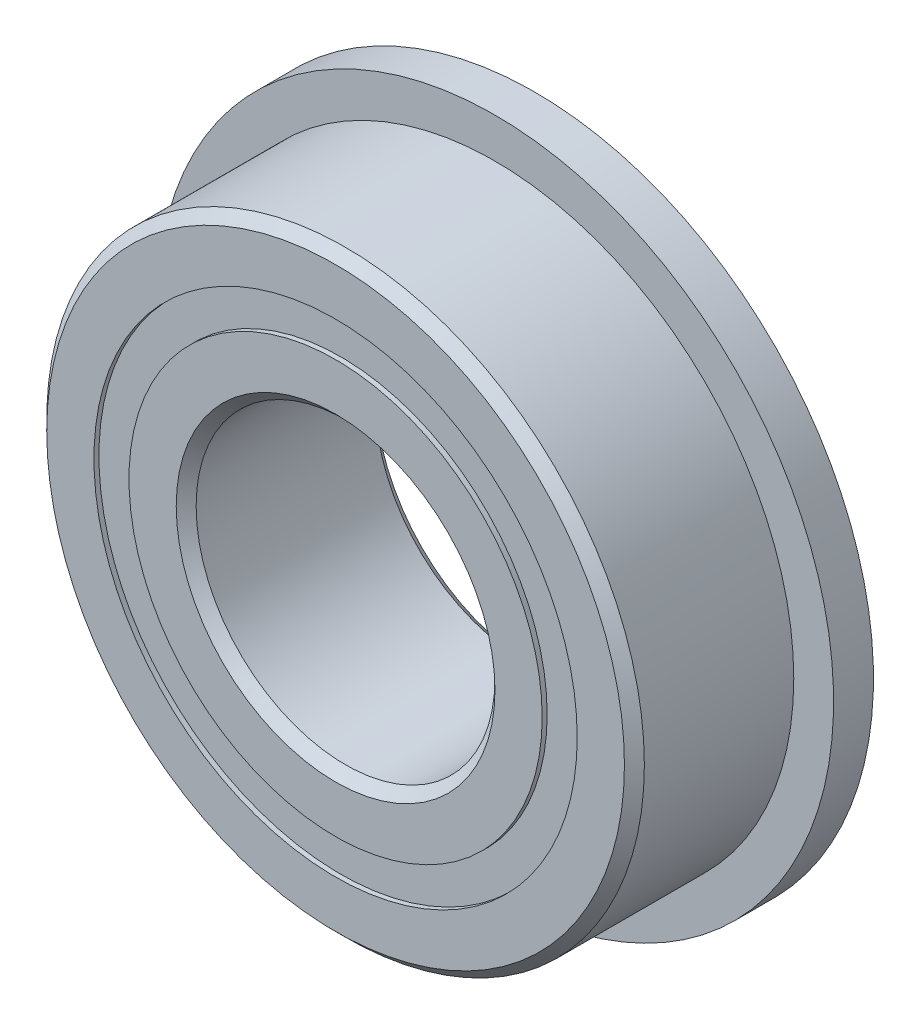
ISO-10303-21;
HEADER;
FILE_DESCRIPTION(('STEP AP214'),'2;1');
FILE_NAME('part.step','',(''),(''),'','','');
FILE_SCHEMA(('AUTOMOTIVE_DESIGN { 1 0 10303 214 1 1 1 1 }'));
ENDSEC;
DATA;
#1=APPLICATION_CONTEXT('core data for automotive mechanical design processes');
#2=APPLICATION_PROTOCOL_DEFINITION('international standard','automotive_design',2000,#1);
#3=PRODUCT_CONTEXT('',#1,'mechanical');
#4=PRODUCT('Part','Part','',(#3));
#5=PRODUCT_RELATED_PRODUCT_CATEGORY('part','',(#4));
#6=PRODUCT_DEFINITION_FORMATION('','',#4);
#7=PRODUCT_DEFINITION_CONTEXT('part definition',#1,'design');
#8=PRODUCT_DEFINITION('design','',#6,#7);
#9=PRODUCT_DEFINITION_SHAPE('','',#8);
#10=(LENGTH_UNIT() NAMED_UNIT(*) SI_UNIT(.MILLI.,.METRE.));
#11=(NAMED_UNIT(*) PLANE_ANGLE_UNIT() SI_UNIT($,.RADIAN.));
#12=(NAMED_UNIT(*) SI_UNIT($,.STERADIAN.) SOLID_ANGLE_UNIT());
#13=UNCERTAINTY_MEASURE_WITH_UNIT(LENGTH_MEASURE(1.E-05),#10,'distance_accuracy_value','');
#14=(GEOMETRIC_REPRESENTATION_CONTEXT(3) GLOBAL_UNCERTAINTY_ASSIGNED_CONTEXT((#13)) GLOBAL_UNIT_ASSIGNED_CONTEXT((#10,
#11,#12)) REPRESENTATION_CONTEXT('',''));
#15=CARTESIAN_POINT('',(0.,0.,0.));
#16=DIRECTION('',(0.,0.,1.));
#17=DIRECTION('',(1.,0.,0.));
#18=AXIS2_PLACEMENT_3D('',#15,#16,#17);
#19=CARTESIAN_POINT('',(0.,4.85164835164835,-1.9));
#20=DIRECTION('',(0.,0.,1.));
#21=DIRECTION('',(1.,0.,0.));
#22=AXIS2_PLACEMENT_3D('',#19,#20,#21);
#23=PLANE('',#22);
#24=CARTESIAN_POINT('',(0.,0.,-1.9));
#25=DIRECTION('',(0.,0.,1.));
#26=DIRECTION('',(1.,0.,0.));
#27=AXIS2_PLACEMENT_3D('',#24,#25,#26);
#28=CIRCLE('',#27,4.85164835164835);
#29=CARTESIAN_POINT('',(4.85164835164835,0.,-1.9));
#30=VERTEX_POINT('',#29);
#31=EDGE_CURVE('E57',#30,#30,#28,.T.);
#32=ORIENTED_EDGE('',*,*,#31,.F.);
#33=EDGE_LOOP('',(#32));
#34=FACE_BOUND('',#33,.T.);
#35=CARTESIAN_POINT('',(0.,0.,-1.9));
#36=DIRECTION('',(0.,0.,1.));
#37=DIRECTION('',(1.,0.,0.));
#38=AXIS2_PLACEMENT_3D('',#35,#36,#37);
#39=CIRCLE('',#38,4.14835164835165);
#40=CARTESIAN_POINT('',(4.14835164835165,0.,-1.9));
#41=VERTEX_POINT('',#40);
#42=EDGE_CURVE('E11',#41,#41,#39,.T.);
#43=ORIENTED_EDGE('',*,*,#42,.T.);
#44=EDGE_LOOP('',(#43));
#45=FACE_BOUND('',#44,.T.);
#46=ADVANCED_FACE('F43',(#34,#45),#23,.F.);
#47=CARTESIAN_POINT('',(0.,0.,2.));
#48=DIRECTION('',(0.,0.,1.));
#49=DIRECTION('',(1.,0.,0.));
#50=AXIS2_PLACEMENT_3D('',#47,#48,#49);
#51=CYLINDRICAL_SURFACE('',#50,4.14835164835165);
#52=ORIENTED_EDGE('',*,*,#42,.F.);
#53=EDGE_LOOP('',(#52));
#54=FACE_BOUND('',#53,.T.);
#55=CARTESIAN_POINT('',(0.,0.,-0.955918417024762));
#56=DIRECTION('',(0.,0.,1.));
#57=DIRECTION('',(1.,0.,0.));
#58=AXIS2_PLACEMENT_3D('',#55,#56,#57);
#59=CIRCLE('',#58,4.14835164835165);
#60=CARTESIAN_POINT('',(4.14835164835165,0.,-0.955918417024762));
#61=VERTEX_POINT('',#60);
#62=EDGE_CURVE('E49',#61,#61,#59,.T.);
#63=ORIENTED_EDGE('',*,*,#62,.T.);
#64=EDGE_LOOP('',(#63));
#65=FACE_BOUND('',#64,.T.);
#66=ADVANCED_FACE('F66',(#54,#65),#51,.F.);
#67=CARTESIAN_POINT('',(0.,4.85164835164835,-0.955918417024762));
#68=DIRECTION('',(0.,0.,-1.));
#69=DIRECTION('',(-1.,0.,0.));
#70=AXIS2_PLACEMENT_3D('',#67,#68,#69);
#71=PLANE('',#70);
#72=ORIENTED_EDGE('',*,*,#62,.F.);
#73=EDGE_LOOP('',(#72));
#74=FACE_BOUND('',#73,.T.);
#75=CARTESIAN_POINT('',(0.,0.,-0.955918417024762));
#76=DIRECTION('',(0.,0.,1.));
#77=DIRECTION('',(1.,0.,0.));
#78=AXIS2_PLACEMENT_3D('',#75,#76,#77);
#79=CIRCLE('',#78,4.85164835164835);
#80=CARTESIAN_POINT('',(4.85164835164835,0.,-0.955918417024762));
#81=VERTEX_POINT('',#80);
#82=EDGE_CURVE('E53',#81,#81,#79,.T.);
#83=ORIENTED_EDGE('',*,*,#82,.T.);
#84=EDGE_LOOP('',(#83));
#85=FACE_BOUND('',#84,.T.);
#86=ADVANCED_FACE('F70',(#74,#85),#71,.F.);
#87=CARTESIAN_POINT('',(0.,0.,2.));
#88=DIRECTION('',(0.,0.,1.));
#89=DIRECTION('',(1.,0.,0.));
#90=AXIS2_PLACEMENT_3D('',#87,#88,#89);
#91=CYLINDRICAL_SURFACE('',#90,4.85164835164835);
#92=ORIENTED_EDGE('',*,*,#82,.F.);
#93=EDGE_LOOP('',(#92));
#94=FACE_BOUND('',#93,.T.);
#95=ORIENTED_EDGE('',*,*,#31,.T.);
#96=EDGE_LOOP('',(#95));
#97=FACE_BOUND('',#96,.T.);
#98=ADVANCED_FACE('F63',(#94,#97),#91,.T.);
#99=CLOSED_SHELL('',(#46,#66,#86,#98));
#100=MANIFOLD_SOLID_BREP('B2',#99);
#101=CARTESIAN_POINT('',(0.,4.85164835164835,1.9));
#102=DIRECTION('',(0.,0.,-1.));
#103=DIRECTION('',(-1.,0.,0.));
#104=AXIS2_PLACEMENT_3D('',#101,#102,#103);
#105=PLANE('',#104);
#106=CARTESIAN_POINT('',(0.,0.,1.9));
#107=DIRECTION('',(0.,0.,1.));
#108=DIRECTION('',(1.,0.,0.));
#109=AXIS2_PLACEMENT_3D('',#106,#107,#108);
#110=CIRCLE('',#109,4.14835164835165);
#111=CARTESIAN_POINT('',(4.14835164835165,0.,1.9));
#112=VERTEX_POINT('',#111);
#113=EDGE_CURVE('E42',#112,#112,#110,.T.);
#114=ORIENTED_EDGE('',*,*,#113,.F.);
#115=EDGE_LOOP('',(#114));
#116=FACE_BOUND('',#115,.T.);
#117=CARTESIAN_POINT('',(0.,0.,1.9));
#118=DIRECTION('',(0.,0.,1.));
#119=DIRECTION('',(1.,0.,0.));
#120=AXIS2_PLACEMENT_3D('',#117,#118,#119);
#121=CIRCLE('',#120,4.85164835164835);
#122=CARTESIAN_POINT('',(4.85164835164835,0.,1.9));
#123=VERTEX_POINT('',#122);
#124=EDGE_CURVE('E124',#123,#123,#121,.T.);
#125=ORIENTED_EDGE('',*,*,#124,.T.);
#126=EDGE_LOOP('',(#125));
#127=FACE_BOUND('',#126,.T.);
#128=ADVANCED_FACE('F110',(#116,#127),#105,.F.);
#129=CARTESIAN_POINT('',(0.,0.,2.));
#130=DIRECTION('',(0.,0.,1.));
#131=DIRECTION('',(1.,0.,0.));
#132=AXIS2_PLACEMENT_3D('',#129,#130,#131);
#133=CYLINDRICAL_SURFACE('',#132,4.14835164835165);
#134=CARTESIAN_POINT('',(0.,0.,0.955918417024761));
#135=DIRECTION('',(0.,0.,1.));
#136=DIRECTION('',(1.,0.,0.));
#137=AXIS2_PLACEMENT_3D('',#134,#135,#136);
#138=CIRCLE('',#137,4.14835164835165);
#139=CARTESIAN_POINT('',(4.14835164835165,0.,0.955918417024761));
#140=VERTEX_POINT('',#139);
#141=EDGE_CURVE('E116',#140,#140,#138,.T.);
#142=ORIENTED_EDGE('',*,*,#141,.F.);
#143=EDGE_LOOP('',(#142));
#144=FACE_BOUND('',#143,.T.);
#145=ORIENTED_EDGE('',*,*,#113,.T.);
#146=EDGE_LOOP('',(#145));
#147=FACE_BOUND('',#146,.T.);
#148=ADVANCED_FACE('F139',(#144,#147),#133,.F.);
#149=CARTESIAN_POINT('',(0.,4.85164835164835,0.955918417024761));
#150=DIRECTION('',(0.,0.,1.));
#151=DIRECTION('',(1.,0.,0.));
#152=AXIS2_PLACEMENT_3D('',#149,#150,#151);
#153=PLANE('',#152);
#154=CARTESIAN_POINT('',(0.,0.,0.955918417024761));
#155=DIRECTION('',(0.,0.,1.));
#156=DIRECTION('',(1.,0.,0.));
#157=AXIS2_PLACEMENT_3D('',#154,#155,#156);
#158=CIRCLE('',#157,4.85164835164835);
#159=CARTESIAN_POINT('',(4.85164835164835,0.,0.955918417024761));
#160=VERTEX_POINT('',#159);
#161=EDGE_CURVE('E120',#160,#160,#158,.T.);
#162=ORIENTED_EDGE('',*,*,#161,.F.);
#163=EDGE_LOOP('',(#162));
#164=FACE_BOUND('',#163,.T.);
#165=ORIENTED_EDGE('',*,*,#141,.T.);
#166=EDGE_LOOP('',(#165));
#167=FACE_BOUND('',#166,.T.);
#168=ADVANCED_FACE('F134',(#164,#167),#153,.F.);
#169=CARTESIAN_POINT('',(0.,0.,2.));
#170=DIRECTION('',(0.,0.,1.));
#171=DIRECTION('',(1.,0.,0.));
#172=AXIS2_PLACEMENT_3D('',#169,#170,#171);
#173=CYLINDRICAL_SURFACE('',#172,4.85164835164835);
#174=ORIENTED_EDGE('',*,*,#124,.F.);
#175=EDGE_LOOP('',(#174));
#176=FACE_BOUND('',#175,.T.);
#177=ORIENTED_EDGE('',*,*,#161,.T.);
#178=EDGE_LOOP('',(#177));
#179=FACE_BOUND('',#178,.T.);
#180=ADVANCED_FACE('F131',(#176,#179),#173,.T.);
#181=CLOSED_SHELL('',(#128,#148,#168,#180));
#182=MANIFOLD_SOLID_BREP('B6',#181);
#183=CARTESIAN_POINT('',(-2.24999999999995,3.89711431703,0.));
#184=DIRECTION('',(0.,0.,1.));
#185=DIRECTION('',(-0.499999999999989,0.866025403784445,0.));
#186=AXIS2_PLACEMENT_3D('',#183,#184,#185);
#187=SPHERICAL_SURFACE('',#186,0.955918417024761);
#188=CARTESIAN_POINT('',(-2.24999999999995,3.89711431703,0.955918417024761));
#189=VERTEX_POINT('',#188);
#190=VERTEX_LOOP('',#189);
#191=FACE_BOUND('',#190,.T.);
#192=ADVANCED_FACE('F177',(#191),#187,.T.);
#193=CLOSED_SHELL('',(#192));
#194=MANIFOLD_SOLID_BREP('B37',#193);
#195=CARTESIAN_POINT('',(-3.89711431702995,2.25000000000005,0.));
#196=DIRECTION('',(0.,0.,1.));
#197=DIRECTION('',(-0.866025403784433,0.50000000000001,0.));
#198=AXIS2_PLACEMENT_3D('',#195,#196,#197);
#199=SPHERICAL_SURFACE('',#198,0.955918417024761);
#200=CARTESIAN_POINT('',(-3.89711431702995,2.25000000000005,0.955918417024761));
#201=VERTEX_POINT('',#200);
#202=VERTEX_LOOP('',#201);
#203=FACE_BOUND('',#202,.T.);
#204=ADVANCED_FACE('F197',(#203),#199,.T.);
#205=CLOSED_SHELL('',(#204));
#206=MANIFOLD_SOLID_BREP('B106',#205);
#207=CARTESIAN_POINT('',(-4.5,0.,0.));
#208=DIRECTION('',(0.,0.,1.));
#209=DIRECTION('',(-1.,0.,0.));
#210=AXIS2_PLACEMENT_3D('',#207,#208,#209);
#211=SPHERICAL_SURFACE('',#210,0.955918417024761);
#212=CARTESIAN_POINT('',(-4.5,0.,0.955918417024761));
#213=VERTEX_POINT('',#212);
#214=VERTEX_LOOP('',#213);
#215=FACE_BOUND('',#214,.T.);
#216=ADVANCED_FACE('F218',(#215),#211,.T.);
#217=CLOSED_SHELL('',(#216));
#218=MANIFOLD_SOLID_BREP('B173',#217);
#219=CARTESIAN_POINT('',(-3.89711431703,-2.24999999999996,0.));
#220=DIRECTION('',(0.,0.,1.));
#221=DIRECTION('',(-0.866025403784443,-0.499999999999992,0.));
#222=AXIS2_PLACEMENT_3D('',#219,#220,#221);
#223=SPHERICAL_SURFACE('',#222,0.955918417024761);
#224=CARTESIAN_POINT('',(-3.89711431703,-2.24999999999996,0.955918417024761));
#225=VERTEX_POINT('',#224);
#226=VERTEX_LOOP('',#225);
#227=FACE_BOUND('',#226,.T.);
#228=ADVANCED_FACE('F241',(#227),#223,.T.);
#229=CLOSED_SHELL('',(#228));
#230=MANIFOLD_SOLID_BREP('B193',#229);
#231=CARTESIAN_POINT('',(-2.25000000000003,-3.89711431702996,0.));
#232=DIRECTION('',(0.,0.,1.));
#233=DIRECTION('',(-0.500000000000007,-0.866025403784435,0.));
#234=AXIS2_PLACEMENT_3D('',#231,#232,#233);
#235=SPHERICAL_SURFACE('',#234,0.955918417024761);
#236=CARTESIAN_POINT('',(-2.25000000000003,-3.89711431702996,0.955918417024761));
#237=VERTEX_POINT('',#236);
#238=VERTEX_LOOP('',#237);
#239=FACE_BOUND('',#238,.T.);
#240=ADVANCED_FACE('F261',(#239),#235,.T.);
#241=CLOSED_SHELL('',(#240));
#242=MANIFOLD_SOLID_BREP('B214',#241);
#243=CARTESIAN_POINT('',(0.,-4.5,0.));
#244=DIRECTION('',(0.,0.,1.));
#245=DIRECTION('',(0.,-1.,0.));
#246=AXIS2_PLACEMENT_3D('',#243,#244,#245);
#247=SPHERICAL_SURFACE('',#246,0.955918417024761);
#248=CARTESIAN_POINT('',(0.,-4.5,0.955918417024761));
#249=VERTEX_POINT('',#248);
#250=VERTEX_LOOP('',#249);
#251=FACE_BOUND('',#250,.T.);
#252=ADVANCED_FACE('F281',(#251),#247,.T.);
#253=CLOSED_SHELL('',(#252));
#254=MANIFOLD_SOLID_BREP('B237',#253);
#255=CARTESIAN_POINT('',(2.24999999999998,-3.89711431702999,0.));
#256=DIRECTION('',(0.,0.,1.));
#257=DIRECTION('',(0.499999999999995,-0.866025403784442,0.));
#258=AXIS2_PLACEMENT_3D('',#255,#256,#257);
#259=SPHERICAL_SURFACE('',#258,0.955918417024761);
#260=CARTESIAN_POINT('',(2.24999999999998,-3.89711431702999,0.955918417024761));
#261=VERTEX_POINT('',#260);
#262=VERTEX_LOOP('',#261);
#263=FACE_BOUND('',#262,.T.);
#264=ADVANCED_FACE('F301',(#263),#259,.T.);
#265=CLOSED_SHELL('',(#264));
#266=MANIFOLD_SOLID_BREP('B257',#265);
#267=CARTESIAN_POINT('',(3.89711431702996,-2.25000000000002,0.));
#268=DIRECTION('',(0.,0.,1.));
#269=DIRECTION('',(0.866025403784436,-0.500000000000004,0.));
#270=AXIS2_PLACEMENT_3D('',#267,#268,#269);
#271=SPHERICAL_SURFACE('',#270,0.955918417024761);
#272=CARTESIAN_POINT('',(3.89711431702996,-2.25000000000002,0.955918417024761));
#273=VERTEX_POINT('',#272);
#274=VERTEX_LOOP('',#273);
#275=FACE_BOUND('',#274,.T.);
#276=ADVANCED_FACE('F321',(#275),#271,.T.);
#277=CLOSED_SHELL('',(#276));
#278=MANIFOLD_SOLID_BREP('B277',#277);
#279=CARTESIAN_POINT('',(4.5,0.,0.));
#280=DIRECTION('',(0.,0.,1.));
#281=DIRECTION('',(1.,0.,0.));
#282=AXIS2_PLACEMENT_3D('',#279,#280,#281);
#283=SPHERICAL_SURFACE('',#282,0.955918417024761);
#284=CARTESIAN_POINT('',(4.5,0.,0.955918417024761));
#285=VERTEX_POINT('',#284);
#286=VERTEX_LOOP('',#285);
#287=FACE_BOUND('',#286,.T.);
#288=ADVANCED_FACE('F341',(#287),#283,.T.);
#289=CLOSED_SHELL('',(#288));
#290=MANIFOLD_SOLID_BREP('B297',#289);
#291=CARTESIAN_POINT('',(3.89711431702998,2.24999999999999,0.));
#292=DIRECTION('',(0.,0.,1.));
#293=DIRECTION('',(0.86602540378444,0.499999999999998,0.));
#294=AXIS2_PLACEMENT_3D('',#291,#292,#293);
#295=SPHERICAL_SURFACE('',#294,0.955918417024761);
#296=CARTESIAN_POINT('',(3.89711431702998,2.24999999999999,0.955918417024761));
#297=VERTEX_POINT('',#296);
#298=VERTEX_LOOP('',#297);
#299=FACE_BOUND('',#298,.T.);
#300=ADVANCED_FACE('F361',(#299),#295,.T.);
#301=CLOSED_SHELL('',(#300));
#302=MANIFOLD_SOLID_BREP('B317',#301);
#303=CARTESIAN_POINT('',(2.25,3.89711431702997,0.));
#304=DIRECTION('',(0.,0.,1.));
#305=DIRECTION('',(0.500000000000001,0.866025403784438,0.));
#306=AXIS2_PLACEMENT_3D('',#303,#304,#305);
#307=SPHERICAL_SURFACE('',#306,0.955918417024761);
#308=CARTESIAN_POINT('',(2.25,3.89711431702997,0.955918417024761));
#309=VERTEX_POINT('',#308);
#310=VERTEX_LOOP('',#309);
#311=FACE_BOUND('',#310,.T.);
#312=ADVANCED_FACE('F381',(#311),#307,.T.);
#313=CLOSED_SHELL('',(#312));
#314=MANIFOLD_SOLID_BREP('B337',#313);
#315=CARTESIAN_POINT('',(0.,4.5,0.));
#316=DIRECTION('',(0.,0.,1.));
#317=DIRECTION('',(0.,1.,0.));
#318=AXIS2_PLACEMENT_3D('',#315,#316,#317);
#319=SPHERICAL_SURFACE('',#318,0.955918417024761);
#320=CARTESIAN_POINT('',(0.,4.5,0.955918417024761));
#321=VERTEX_POINT('',#320);
#322=VERTEX_LOOP('',#321);
#323=FACE_BOUND('',#322,.T.);
#324=ADVANCED_FACE('F404',(#323),#319,.T.);
#325=CLOSED_SHELL('',(#324));
#326=MANIFOLD_SOLID_BREP('B357',#325);
#327=CARTESIAN_POINT('',(0.,4.14835164835165,2.));
#328=DIRECTION('',(0.,0.,-1.));
#329=DIRECTION('',(-1.,0.,0.));
#330=AXIS2_PLACEMENT_3D('',#327,#328,#329);
#331=PLANE('',#330);
#332=CARTESIAN_POINT('',(0.,0.,2.));
#333=DIRECTION('',(0.,0.,1.));
#334=DIRECTION('',(1.,0.,0.));
#335=AXIS2_PLACEMENT_3D('',#332,#333,#334);
#336=CIRCLE('',#335,3.2);
#337=CARTESIAN_POINT('',(3.2,0.,2.));
#338=VERTEX_POINT('',#337);
#339=EDGE_CURVE('E455',#338,#338,#336,.T.);
#340=ORIENTED_EDGE('',*,*,#339,.F.);
#341=EDGE_LOOP('',(#340));
#342=FACE_BOUND('',#341,.T.);
#343=CARTESIAN_POINT('',(0.,0.,2.));
#344=DIRECTION('',(0.,0.,1.));
#345=DIRECTION('',(1.,0.,0.));
#346=AXIS2_PLACEMENT_3D('',#343,#344,#345);
#347=CIRCLE('',#346,4.14835164835165);
#348=CARTESIAN_POINT('',(4.14835164835165,0.,2.));
#349=VERTEX_POINT('',#348);
#350=EDGE_CURVE('E403',#349,#349,#347,.T.);
#351=ORIENTED_EDGE('',*,*,#350,.T.);
#352=EDGE_LOOP('',(#351));
#353=FACE_BOUND('',#352,.T.);
#354=ADVANCED_FACE('F427',(#342,#353),#331,.F.);
#355=CARTESIAN_POINT('',(0.,0.,2.));
#356=DIRECTION('',(0.,0.,1.));
#357=DIRECTION('',(1.,0.,0.));
#358=AXIS2_PLACEMENT_3D('',#355,#356,#357);
#359=CYLINDRICAL_SURFACE('',#358,4.14835164835165);
#360=ORIENTED_EDGE('',*,*,#350,.F.);
#361=EDGE_LOOP('',(#360));
#362=FACE_BOUND('',#361,.T.);
#363=CARTESIAN_POINT('',(0.,0.,0.888888888888889));
#364=DIRECTION('',(0.,0.,1.));
#365=DIRECTION('',(1.,0.,0.));
#366=AXIS2_PLACEMENT_3D('',#363,#364,#365);
#367=CIRCLE('',#366,4.14835164835165);
#368=CARTESIAN_POINT('',(4.14835164835165,0.,0.888888888888889));
#369=VERTEX_POINT('',#368);
#370=EDGE_CURVE('E433',#369,#369,#367,.T.);
#371=ORIENTED_EDGE('',*,*,#370,.T.);
#372=EDGE_LOOP('',(#371));
#373=FACE_BOUND('',#372,.T.);
#374=ADVANCED_FACE('F462',(#362,#373),#359,.T.);
#375=CARTESIAN_POINT('',(0.,0.,0.));
#376=DIRECTION('',(0.,0.,1.));
#377=DIRECTION('',(1.,0.,0.));
#378=AXIS2_PLACEMENT_3D('',#375,#376,#377);
#379=TOROIDAL_SURFACE('',#378,4.5,0.95591841702476);
#380=ORIENTED_EDGE('',*,*,#370,.F.);
#381=EDGE_LOOP('',(#380));
#382=FACE_BOUND('',#381,.T.);
#383=CARTESIAN_POINT('',(0.,0.,-0.88888888888889));
#384=DIRECTION('',(0.,0.,1.));
#385=DIRECTION('',(1.,0.,0.));
#386=AXIS2_PLACEMENT_3D('',#383,#384,#385);
#387=CIRCLE('',#386,4.14835164835165);
#388=CARTESIAN_POINT('',(4.14835164835165,0.,-0.88888888888889));
#389=VERTEX_POINT('',#388);
#390=EDGE_CURVE('E437',#389,#389,#387,.T.);
#391=ORIENTED_EDGE('',*,*,#390,.T.);
#392=EDGE_LOOP('',(#391));
#393=FACE_BOUND('',#392,.T.);
#394=ADVANCED_FACE('F466',(#382,#393),#379,.F.);
#395=CARTESIAN_POINT('',(0.,0.,2.));
#396=DIRECTION('',(0.,0.,1.));
#397=DIRECTION('',(1.,0.,0.));
#398=AXIS2_PLACEMENT_3D('',#395,#396,#397);
#399=CYLINDRICAL_SURFACE('',#398,4.14835164835165);
#400=ORIENTED_EDGE('',*,*,#390,.F.);
#401=EDGE_LOOP('',(#400));
#402=FACE_BOUND('',#401,.T.);
#403=CARTESIAN_POINT('',(0.,0.,-2.));
#404=DIRECTION('',(0.,0.,1.));
#405=DIRECTION('',(1.,0.,0.));
#406=AXIS2_PLACEMENT_3D('',#403,#404,#405);
#407=CIRCLE('',#406,4.14835164835165);
#408=CARTESIAN_POINT('',(4.14835164835165,0.,-2.));
#409=VERTEX_POINT('',#408);
#410=EDGE_CURVE('E441',#409,#409,#407,.T.);
#411=ORIENTED_EDGE('',*,*,#410,.T.);
#412=EDGE_LOOP('',(#411));
#413=FACE_BOUND('',#412,.T.);
#414=ADVANCED_FACE('F471',(#402,#413),#399,.T.);
#415=CARTESIAN_POINT('',(0.,3.2,-2.));
#416=DIRECTION('',(0.,0.,1.));
#417=DIRECTION('',(1.,0.,0.));
#418=AXIS2_PLACEMENT_3D('',#415,#416,#417);
#419=PLANE('',#418);
#420=ORIENTED_EDGE('',*,*,#410,.F.);
#421=EDGE_LOOP('',(#420));
#422=FACE_BOUND('',#421,.T.);
#423=CARTESIAN_POINT('',(0.,0.,-2.));
#424=DIRECTION('',(0.,0.,1.));
#425=DIRECTION('',(1.,0.,0.));
#426=AXIS2_PLACEMENT_3D('',#423,#424,#425);
#427=CIRCLE('',#426,3.2);
#428=CARTESIAN_POINT('',(3.2,0.,-2.));
#429=VERTEX_POINT('',#428);
#430=EDGE_CURVE('E446',#429,#429,#427,.T.);
#431=ORIENTED_EDGE('',*,*,#430,.T.);
#432=EDGE_LOOP('',(#431));
#433=FACE_BOUND('',#432,.T.);
#434=ADVANCED_FACE('F477',(#422,#433),#419,.F.);
#435=CARTESIAN_POINT('',(0.,0.,-1.8));
#436=DIRECTION('',(0.,0.,-1.));
#437=DIRECTION('',(-1.,0.,0.));
#438=AXIS2_PLACEMENT_3D('',#435,#436,#437);
#439=CONICAL_SURFACE('',#438,3.,0.785398163397452);
#440=ORIENTED_EDGE('',*,*,#430,.F.);
#441=EDGE_LOOP('',(#440));
#442=FACE_BOUND('',#441,.T.);
#443=CARTESIAN_POINT('',(0.,0.,-1.8));
#444=DIRECTION('',(0.,0.,1.));
#445=DIRECTION('',(1.,0.,0.));
#446=AXIS2_PLACEMENT_3D('',#443,#444,#445);
#447=CIRCLE('',#446,3.);
#448=CARTESIAN_POINT('',(3.,0.,-1.8));
#449=VERTEX_POINT('',#448);
#450=EDGE_CURVE('E449',#449,#449,#447,.T.);
#451=ORIENTED_EDGE('',*,*,#450,.T.);
#452=EDGE_LOOP('',(#451));
#453=FACE_BOUND('',#452,.T.);
#454=ADVANCED_FACE('F481',(#442,#453),#439,.F.);
#455=CARTESIAN_POINT('',(0.,0.,2.));
#456=DIRECTION('',(0.,0.,1.));
#457=DIRECTION('',(1.,0.,0.));
#458=AXIS2_PLACEMENT_3D('',#455,#456,#457);
#459=CYLINDRICAL_SURFACE('',#458,3.);
#460=ORIENTED_EDGE('',*,*,#450,.F.);
#461=EDGE_LOOP('',(#460));
#462=FACE_BOUND('',#461,.T.);
#463=CARTESIAN_POINT('',(0.,0.,1.8));
#464=DIRECTION('',(0.,0.,1.));
#465=DIRECTION('',(1.,0.,0.));
#466=AXIS2_PLACEMENT_3D('',#463,#464,#465);
#467=CIRCLE('',#466,3.);
#468=CARTESIAN_POINT('',(3.,0.,1.8));
#469=VERTEX_POINT('',#468);
#470=EDGE_CURVE('E452',#469,#469,#467,.T.);
#471=ORIENTED_EDGE('',*,*,#470,.T.);
#472=EDGE_LOOP('',(#471));
#473=FACE_BOUND('',#472,.T.);
#474=ADVANCED_FACE('F485',(#462,#473),#459,.F.);
#475=CARTESIAN_POINT('',(0.,0.,2.));
#476=DIRECTION('',(0.,0.,1.));
#477=DIRECTION('',(1.,0.,0.));
#478=AXIS2_PLACEMENT_3D('',#475,#476,#477);
#479=CONICAL_SURFACE('',#478,3.2,0.785398163397443);
#480=ORIENTED_EDGE('',*,*,#470,.F.);
#481=EDGE_LOOP('',(#480));
#482=FACE_BOUND('',#481,.T.);
#483=ORIENTED_EDGE('',*,*,#339,.T.);
#484=EDGE_LOOP('',(#483));
#485=FACE_BOUND('',#484,.T.);
#486=ADVANCED_FACE('F459',(#482,#485),#479,.F.);
#487=CLOSED_SHELL('',(#354,#374,#394,#414,#434,#454,#474,#486));
#488=MANIFOLD_SOLID_BREP('B377',#487);
#489=CARTESIAN_POINT('',(0.,0.,1.8));
#490=DIRECTION('',(0.,0.,-1.));
#491=DIRECTION('',(-1.,0.,0.));
#492=AXIS2_PLACEMENT_3D('',#489,#490,#491);
#493=CONICAL_SURFACE('',#492,6.,0.785398163397449);
#494=CARTESIAN_POINT('',(0.,0.,2.));
#495=DIRECTION('',(0.,0.,1.));
#496=DIRECTION('',(1.,0.,0.));
#497=AXIS2_PLACEMENT_3D('',#494,#495,#496);
#498=CIRCLE('',#497,5.8);
#499=CARTESIAN_POINT('',(5.8,0.,2.));
#500=VERTEX_POINT('',#499);
#501=EDGE_CURVE('E573',#500,#500,#498,.T.);
#502=ORIENTED_EDGE('',*,*,#501,.F.);
#503=EDGE_LOOP('',(#502));
#504=FACE_BOUND('',#503,.T.);
#505=CARTESIAN_POINT('',(0.,0.,1.8));
#506=DIRECTION('',(0.,0.,1.));
#507=DIRECTION('',(1.,0.,0.));
#508=AXIS2_PLACEMENT_3D('',#505,#506,#507);
#509=CIRCLE('',#508,6.);
#510=CARTESIAN_POINT('',(6.,0.,1.8));
#511=VERTEX_POINT('',#510);
#512=EDGE_CURVE('E426',#511,#511,#509,.T.);
#513=ORIENTED_EDGE('',*,*,#512,.T.);
#514=EDGE_LOOP('',(#513));
#515=FACE_BOUND('',#514,.T.);
#516=ADVANCED_FACE('F551',(#504,#515),#493,.T.);
#517=CARTESIAN_POINT('',(0.,0.,2.));
#518=DIRECTION('',(0.,0.,1.));
#519=DIRECTION('',(1.,0.,0.));
#520=AXIS2_PLACEMENT_3D('',#517,#518,#519);
#521=CYLINDRICAL_SURFACE('',#520,6.);
#522=CARTESIAN_POINT('',(0.,0.,-1.2));
#523=DIRECTION('',(0.,0.,1.));
#524=DIRECTION('',(1.,0.,0.));
#525=AXIS2_PLACEMENT_3D('',#522,#523,#524);
#526=CIRCLE('',#525,6.);
#527=CARTESIAN_POINT('',(6.,0.,-1.2));
#528=VERTEX_POINT('',#527);
#529=EDGE_CURVE('E576',#528,#528,#526,.T.);
#530=ORIENTED_EDGE('',*,*,#529,.T.);
#531=EDGE_LOOP('',(#530));
#532=FACE_BOUND('',#531,.T.);
#533=ORIENTED_EDGE('',*,*,#512,.F.);
#534=EDGE_LOOP('',(#533));
#535=FACE_BOUND('',#534,.T.);
#536=ADVANCED_FACE('F596',(#532,#535),#521,.T.);
#537=CARTESIAN_POINT('',(0.,5.8,-2.));
#538=DIRECTION('',(0.,0.,1.));
#539=DIRECTION('',(1.,0.,0.));
#540=AXIS2_PLACEMENT_3D('',#537,#538,#539);
#541=PLANE('',#540);
#542=CARTESIAN_POINT('',(0.,0.,-2.));
#543=DIRECTION('',(0.,0.,1.));
#544=DIRECTION('',(1.,0.,0.));
#545=AXIS2_PLACEMENT_3D('',#542,#543,#544);
#546=CIRCLE('',#545,4.85164835164835);
#547=CARTESIAN_POINT('',(4.85164835164835,0.,-2.));
#548=VERTEX_POINT('',#547);
#549=EDGE_CURVE('E557',#548,#548,#546,.T.);
#550=ORIENTED_EDGE('',*,*,#549,.T.);
#551=EDGE_LOOP('',(#550));
#552=FACE_BOUND('',#551,.T.);
#553=CARTESIAN_POINT('',(0.,0.,-2.));
#554=DIRECTION('',(0.,0.,-1.));
#555=DIRECTION('',(-1.,0.,0.));
#556=AXIS2_PLACEMENT_3D('',#553,#554,#555);
#557=CIRCLE('',#556,6.8);
#558=CARTESIAN_POINT('',(-6.8,0.,-2.));
#559=VERTEX_POINT('',#558);
#560=EDGE_CURVE('E579',#559,#559,#557,.T.);
#561=ORIENTED_EDGE('',*,*,#560,.T.);
#562=EDGE_LOOP('',(#561));
#563=FACE_BOUND('',#562,.T.);
#564=ADVANCED_FACE('F599',(#552,#563),#541,.F.);
#565=CARTESIAN_POINT('',(0.,0.,2.));
#566=DIRECTION('',(0.,0.,1.));
#567=DIRECTION('',(1.,0.,0.));
#568=AXIS2_PLACEMENT_3D('',#565,#566,#567);
#569=CYLINDRICAL_SURFACE('',#568,4.85164835164835);
#570=CARTESIAN_POINT('',(0.,0.,-0.888888888888889));
#571=DIRECTION('',(0.,0.,1.));
#572=DIRECTION('',(1.,0.,0.));
#573=AXIS2_PLACEMENT_3D('',#570,#571,#572);
#574=CIRCLE('',#573,4.85164835164835);
#575=CARTESIAN_POINT('',(4.85164835164835,0.,-0.888888888888889));
#576=VERTEX_POINT('',#575);
#577=EDGE_CURVE('E561',#576,#576,#574,.T.);
#578=ORIENTED_EDGE('',*,*,#577,.T.);
#579=EDGE_LOOP('',(#578));
#580=FACE_BOUND('',#579,.T.);
#581=ORIENTED_EDGE('',*,*,#549,.F.);
#582=EDGE_LOOP('',(#581));
#583=FACE_BOUND('',#582,.T.);
#584=ADVANCED_FACE('F604',(#580,#583),#569,.F.);
#585=CARTESIAN_POINT('',(0.,0.,0.));
#586=DIRECTION('',(0.,0.,1.));
#587=DIRECTION('',(1.,0.,0.));
#588=AXIS2_PLACEMENT_3D('',#585,#586,#587);
#589=TOROIDAL_SURFACE('',#588,4.5,0.955918417024761);
#590=ORIENTED_EDGE('',*,*,#577,.F.);
#591=EDGE_LOOP('',(#590));
#592=FACE_BOUND('',#591,.T.);
#593=CARTESIAN_POINT('',(0.,0.,0.888888888888889));
#594=DIRECTION('',(0.,0.,1.));
#595=DIRECTION('',(1.,0.,0.));
#596=AXIS2_PLACEMENT_3D('',#593,#594,#595);
#597=CIRCLE('',#596,4.85164835164835);
#598=CARTESIAN_POINT('',(4.85164835164835,0.,0.888888888888889));
#599=VERTEX_POINT('',#598);
#600=EDGE_CURVE('E565',#599,#599,#597,.T.);
#601=ORIENTED_EDGE('',*,*,#600,.T.);
#602=EDGE_LOOP('',(#601));
#603=FACE_BOUND('',#602,.T.);
#604=ADVANCED_FACE('F610',(#592,#603),#589,.F.);
#605=CARTESIAN_POINT('',(0.,0.,2.));
#606=DIRECTION('',(0.,0.,1.));
#607=DIRECTION('',(1.,0.,0.));
#608=AXIS2_PLACEMENT_3D('',#605,#606,#607);
#609=CYLINDRICAL_SURFACE('',#608,4.85164835164835);
#610=ORIENTED_EDGE('',*,*,#600,.F.);
#611=EDGE_LOOP('',(#610));
#612=FACE_BOUND('',#611,.T.);
#613=CARTESIAN_POINT('',(0.,0.,2.));
#614=DIRECTION('',(0.,0.,1.));
#615=DIRECTION('',(1.,0.,0.));
#616=AXIS2_PLACEMENT_3D('',#613,#614,#615);
#617=CIRCLE('',#616,4.85164835164835);
#618=CARTESIAN_POINT('',(4.85164835164835,0.,2.));
#619=VERTEX_POINT('',#618);
#620=EDGE_CURVE('E570',#619,#619,#617,.T.);
#621=ORIENTED_EDGE('',*,*,#620,.T.);
#622=EDGE_LOOP('',(#621));
#623=FACE_BOUND('',#622,.T.);
#624=ADVANCED_FACE('F614',(#612,#623),#609,.F.);
#625=CARTESIAN_POINT('',(0.,5.8,2.));
#626=DIRECTION('',(0.,0.,-1.));
#627=DIRECTION('',(-1.,0.,0.));
#628=AXIS2_PLACEMENT_3D('',#625,#626,#627);
#629=PLANE('',#628);
#630=ORIENTED_EDGE('',*,*,#620,.F.);
#631=EDGE_LOOP('',(#630));
#632=FACE_BOUND('',#631,.T.);
#633=ORIENTED_EDGE('',*,*,#501,.T.);
#634=EDGE_LOOP('',(#633));
#635=FACE_BOUND('',#634,.T.);
#636=ADVANCED_FACE('F592',(#632,#635),#629,.F.);
#637=CARTESIAN_POINT('',(0.,4.85164835164835,-1.2));
#638=DIRECTION('',(0.,0.,1.));
#639=DIRECTION('',(1.,0.,0.));
#640=AXIS2_PLACEMENT_3D('',#637,#638,#639);
#641=PLANE('',#640);
#642=CARTESIAN_POINT('',(0.,0.,-1.2));
#643=DIRECTION('',(0.,0.,-1.));
#644=DIRECTION('',(-1.,0.,0.));
#645=AXIS2_PLACEMENT_3D('',#642,#643,#644);
#646=CIRCLE('',#645,6.8);
#647=CARTESIAN_POINT('',(-6.8,0.,-1.2));
#648=VERTEX_POINT('',#647);
#649=EDGE_CURVE('E582',#648,#648,#646,.T.);
#650=ORIENTED_EDGE('',*,*,#649,.F.);
#651=EDGE_LOOP('',(#650));
#652=FACE_BOUND('',#651,.T.);
#653=ORIENTED_EDGE('',*,*,#529,.F.);
#654=EDGE_LOOP('',(#653));
#655=FACE_BOUND('',#654,.T.);
#656=ADVANCED_FACE('F589',(#652,#655),#641,.T.);
#657=CARTESIAN_POINT('',(0.,0.,-2.));
#658=DIRECTION('',(0.,0.,-1.));
#659=DIRECTION('',(-1.,0.,0.));
#660=AXIS2_PLACEMENT_3D('',#657,#658,#659);
#661=CYLINDRICAL_SURFACE('',#660,6.8);
#662=ORIENTED_EDGE('',*,*,#649,.T.);
#663=EDGE_LOOP('',(#662));
#664=FACE_BOUND('',#663,.T.);
#665=ORIENTED_EDGE('',*,*,#560,.F.);
#666=EDGE_LOOP('',(#665));
#667=FACE_BOUND('',#666,.T.);
#668=ADVANCED_FACE('F586',(#664,#667),#661,.T.);
#669=CLOSED_SHELL('',(#516,#536,#564,#584,#604,#624,#636,#656,#668));
#670=MANIFOLD_SOLID_BREP('B398',#669);
#671=ADVANCED_BREP_SHAPE_REPRESENTATION('',(#18,#100,#182,#194,#206,#218,#230,#242,#254,#266,
#278,#290,#302,#314,#326,#488,#670),#14);
#672=SHAPE_DEFINITION_REPRESENTATION(#9,#671);
ENDSEC;
END-ISO-10303-21;
